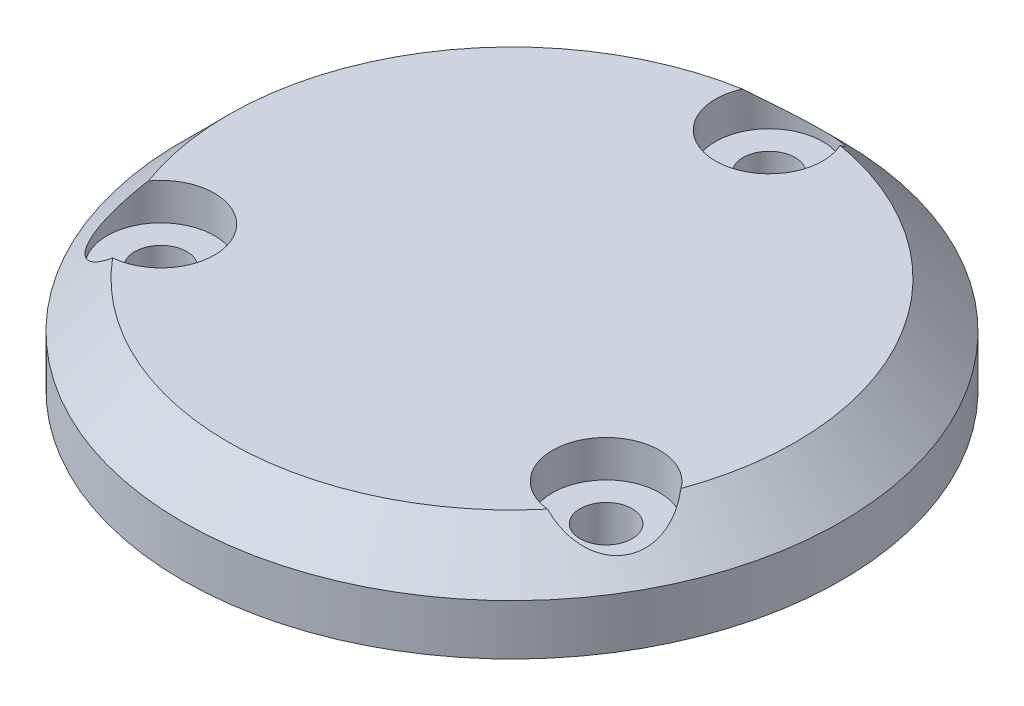
ISO-10303-21;
HEADER;
FILE_DESCRIPTION(('STEP AP214'),'2;1');
FILE_NAME('part.step','',(''),(''),'','','');
FILE_SCHEMA(('AUTOMOTIVE_DESIGN { 1 0 10303 214 1 1 1 1 }'));
ENDSEC;
DATA;
#1=APPLICATION_CONTEXT('core data for automotive mechanical design processes');
#2=APPLICATION_PROTOCOL_DEFINITION('international standard','automotive_design',2000,#1);
#3=PRODUCT_CONTEXT('',#1,'mechanical');
#4=PRODUCT('Part','Part','',(#3));
#5=PRODUCT_RELATED_PRODUCT_CATEGORY('part','',(#4));
#6=PRODUCT_DEFINITION_FORMATION('','',#4);
#7=PRODUCT_DEFINITION_CONTEXT('part definition',#1,'design');
#8=PRODUCT_DEFINITION('design','',#6,#7);
#9=PRODUCT_DEFINITION_SHAPE('','',#8);
#10=(LENGTH_UNIT() NAMED_UNIT(*) SI_UNIT(.MILLI.,.METRE.));
#11=(NAMED_UNIT(*) PLANE_ANGLE_UNIT() SI_UNIT($,.RADIAN.));
#12=(NAMED_UNIT(*) SI_UNIT($,.STERADIAN.) SOLID_ANGLE_UNIT());
#13=UNCERTAINTY_MEASURE_WITH_UNIT(LENGTH_MEASURE(1.E-05),#10,'distance_accuracy_value','');
#14=(GEOMETRIC_REPRESENTATION_CONTEXT(3) GLOBAL_UNCERTAINTY_ASSIGNED_CONTEXT((#13)) GLOBAL_UNIT_ASSIGNED_CONTEXT((#10,
#11,#12)) REPRESENTATION_CONTEXT('',''));
#15=CARTESIAN_POINT('',(0.,0.,0.));
#16=DIRECTION('',(0.,0.,1.));
#17=DIRECTION('',(1.,0.,0.));
#18=AXIS2_PLACEMENT_3D('',#15,#16,#17);
#19=CARTESIAN_POINT('',(0.,0.,0.));
#20=DIRECTION('',(0.,-1.,0.));
#21=DIRECTION('',(0.,0.,1.));
#22=AXIS2_PLACEMENT_3D('',#19,#20,#21);
#23=CONICAL_SURFACE('',#22,21.5,0.78539816339745);
#24=CARTESIAN_POINT('',(0.,3.,0.));
#25=DIRECTION('',(0.,1.,0.));
#26=DIRECTION('',(0.,0.,1.));
#27=AXIS2_PLACEMENT_3D('',#24,#25,#26);
#28=CIRCLE('',#27,18.5);
#29=CARTESIAN_POINT('',(17.3746610155181,3.,6.35382991555764));
#30=VERTEX_POINT('',#29);
#31=CARTESIAN_POINT('',(3.18475238956052,3.,-18.2238127793606));
#32=VERTEX_POINT('',#31);
#33=EDGE_CURVE('E76',#30,#32,#28,.T.);
#34=ORIENTED_EDGE('',*,*,#33,.F.);
#35=CARTESIAN_POINT('',(17.3745202408479,3.0002,6.35363253897836));
#36=CARTESIAN_POINT('',(17.4408834815488,2.90590349368825,6.44669053262444));
#37=CARTESIAN_POINT('',(17.5035508380758,2.81323765815927,6.54417719327068));
#38=CARTESIAN_POINT('',(17.620389713538,2.63180283355036,6.74806807999824));
#39=CARTESIAN_POINT('',(17.6745370575812,2.54304542985675,6.85449641180674));
#40=CARTESIAN_POINT('',(17.7732567163015,2.36988104281534,7.07673061506786));
#41=CARTESIAN_POINT('',(17.817745577553,2.28551642175723,7.19260717017322));
#42=CARTESIAN_POINT('',(17.8950256904219,2.12312238685081,7.43240999108055));
#43=CARTESIAN_POINT('',(17.9278195054571,2.04509158760248,7.5563344858199));
#44=CARTESIAN_POINT('',(17.9869703072409,1.87705860219996,7.84519214050658));
#45=CARTESIAN_POINT('',(18.0093417574277,1.7893351627532,8.01231391284139));
#46=CARTESIAN_POINT('',(18.0291408416712,1.62960245637797,8.35497884383426));
#47=CARTESIAN_POINT('',(18.0266476619816,1.55754404977609,8.5304934976238));
#48=CARTESIAN_POINT('',(18.001982393865,1.46343693424988,8.79770675194085));
#49=CARTESIAN_POINT('',(17.9901448797507,1.43427284469639,8.8879592894284));
#50=CARTESIAN_POINT('',(17.9590997492058,1.38126229939119,9.06873935987347));
#51=CARTESIAN_POINT('',(17.9398962036225,1.35741291794821,9.15926671358677));
#52=CARTESIAN_POINT('',(17.8939536185924,1.31544622034291,9.33974669251927));
#53=CARTESIAN_POINT('',(17.867214183496,1.29732920524765,9.42969928730878));
#54=CARTESIAN_POINT('',(17.8062016273403,1.26718269802608,9.60805535998536));
#55=CARTESIAN_POINT('',(17.7719298920767,1.25515208746318,9.69645911960164));
#56=CARTESIAN_POINT('',(17.7014400395264,1.23868679855146,9.85831760835918));
#57=CARTESIAN_POINT('',(17.6661906129192,1.23341563635561,9.93211143936025));
#58=CARTESIAN_POINT('',(17.5905063200581,1.22761621961303,10.0772178737105));
#59=CARTESIAN_POINT('',(17.5500698216968,1.22708946161983,10.1485296870779));
#60=CARTESIAN_POINT('',(17.4643804169535,1.23079310342182,10.2879954726762));
#61=CARTESIAN_POINT('',(17.4191313242759,1.23501976146686,10.3561518848029));
#62=CARTESIAN_POINT('',(17.3242067089713,1.24815020094312,10.4888470025768));
#63=CARTESIAN_POINT('',(17.2745295323794,1.25705573614484,10.5533843416514));
#64=CARTESIAN_POINT('',(17.1267617187349,1.28904928728341,10.7321381288477));
#65=CARTESIAN_POINT('',(17.0237500685274,1.31774851664976,10.8413909819881));
#66=CARTESIAN_POINT('',(16.8074909983411,1.38948006796563,11.0436394321701));
#67=CARTESIAN_POINT('',(16.694242693125,1.43251363037388,11.1366336211635));
#68=CARTESIAN_POINT('',(16.4522014492174,1.53473529297177,11.311851812817));
#69=CARTESIAN_POINT('',(16.3228778480425,1.59487891454827,11.3927802343212));
#70=CARTESIAN_POINT('',(16.0598297983463,1.72726659139198,11.5352022938071));
#71=CARTESIAN_POINT('',(15.9261019347735,1.79952022309339,11.5966804387844));
#72=CARTESIAN_POINT('',(15.5948733256104,1.98975422086964,11.7252475569562));
#73=CARTESIAN_POINT('',(15.3965134681776,2.11341690607473,11.7817548018549));
#74=CARTESIAN_POINT('',(15.0032495667299,2.37640660799702,11.8590594952725));
#75=CARTESIAN_POINT('',(14.8083506383994,2.5157548869167,11.8798078353438));
#76=CARTESIAN_POINT('',(14.5448319648297,2.71582496173181,11.8867703796734));
#77=CARTESIAN_POINT('',(14.4727029266071,2.77184017258531,11.886409708216));
#78=CARTESIAN_POINT('',(14.3300412025687,2.8850916839218,11.8813556271393));
#79=CARTESIAN_POINT('',(14.2595032032715,2.94232206815479,11.8766799056237));
#80=CARTESIAN_POINT('',(14.1896673054908,3.0002,11.8699596376519));
#81=B_SPLINE_CURVE_WITH_KNOTS('',3,(#35,#36,#37,#38,#39,#40,#41,#42,#43,#44,#45,#46,#47,#48,#49,
#50,#51,#52,#53,#54,#55,#56,#57,#58,#59,#60,#61,#62,#63,#64,#65,#66,#67,#68,#69,#70,#71,#72,#73,
#74,#75,#76,#77,#78,#79,#80),.UNSPECIFIED.,.F.,.F.,(4,2,2,2,2,2,2,2,2,2,2,2,2,2,2,2,2,2,2,2,2,2,
4),(0.,0.444533927812083,0.890307285921158,1.33979122177654,1.78917657535826,2.35721131959742,
2.92343762577456,3.20982621608787,3.49605676087222,3.78230233614892,4.06849529186779,
4.31401824830541,4.55961864868957,4.8050258548539,5.05052511201186,5.50697670387208,
5.96346780622246,6.4535407808461,6.94400314310954,7.66155467595662,8.3800908543357,
8.65397905030182,8.92674949638372),.UNSPECIFIED.);
#82=CARTESIAN_POINT('',(14.1899086259576,3.,11.8699828638029));
#83=VERTEX_POINT('',#82);
#84=EDGE_CURVE('E11',#30,#83,#81,.T.);
#85=ORIENTED_EDGE('',*,*,#84,.T.);
#86=CARTESIAN_POINT('',(-14.1899086259575,3.,11.8699828638029));
#87=VERTEX_POINT('',#86);
#88=EDGE_CURVE('E78',#87,#83,#28,.T.);
#89=ORIENTED_EDGE('',*,*,#88,.F.);
#90=CARTESIAN_POINT('',(-14.1896673054907,3.0002,11.869959637652));
#91=CARTESIAN_POINT('',(-14.3034395123638,2.90590349368824,11.8809028931534));
#92=CARTESIAN_POINT('',(-14.4191991152771,2.81323765815926,11.8864310855707));
#93=CARTESIAN_POINT('',(-14.6541932405144,2.63180283355035,11.8856710765067));
#94=CARTESIAN_POINT('',(-14.7734365515645,2.54304542985675,11.8793498860914));
#95=CARTESIAN_POINT('',(-15.0152568465386,2.36988104281534,11.8537265167656));
#96=CARTESIAN_POINT('',(-15.1378533175886,2.28551642175723,11.8343167232421));
#97=CARTESIAN_POINT('',(-15.384168708828,2.12312238685081,11.7813418537403));
#98=CARTESIAN_POINT('',(-15.5078873769411,2.04509158760248,11.7477798832781));
#99=CARTESIAN_POINT('',(-15.7876208448692,1.87705860219996,11.6545771529337));
#100=CARTESIAN_POINT('',(-15.94353827033,1.7893351627532,11.5903905109475));
#101=CARTESIAN_POINT('',(-16.2501943476776,1.62960245637797,11.4362045553776));
#102=CARTESIAN_POINT('',(-16.400947906751,1.55754404977609,11.3462880715355));
#103=CARTESIAN_POINT('',(-16.6200287391592,1.46343693424988,11.1913206955969));
#104=CARTESIAN_POINT('',(-16.6922709723222,1.43427284469639,11.1359428389124));
#105=CARTESIAN_POINT('',(-16.8333085405532,1.3812622993912,11.0186669319742));
#106=CARTESIAN_POINT('',(-16.9021057558146,1.35741291794821,10.9567724967997));
#107=CARTESIAN_POINT('',(-17.0354347099296,1.31544622034292,10.8267450615819));
#108=CARTESIAN_POINT('',(-17.0999662246054,1.29732920524766,10.7586117341108));
#109=CARTESIAN_POINT('',(-17.2239208363847,1.26718269802608,10.6165952741918));
#110=CARTESIAN_POINT('',(-17.2833448703707,1.25515208746318,10.5427132010136));
#111=CARTESIAN_POINT('',(-17.3882735071777,1.23868679855147,10.4007379536173));
#112=CARTESIAN_POINT('',(-17.4345561261636,1.23341563635561,10.333314139206));
#113=CARTESIAN_POINT('',(-17.522379838133,1.22761621961303,10.1952164017458));
#114=CARTESIAN_POINT('',(-17.5639194309184,1.22708946161983,10.1245414602411));
#115=CARTESIAN_POINT('',(-17.6418556418336,1.23079310342182,9.98059936609903));
#116=CARTESIAN_POINT('',(-17.6782562798274,1.23501976146686,9.90733429627872));
#117=CARTESIAN_POINT('',(-17.7457113151255,1.24815020094312,9.75877960909355));
#118=CARTESIAN_POINT('',(-17.7767637019607,1.25705573614484,9.68348924263931));
#119=CARTESIAN_POINT('',(-17.8576851158731,1.28904928728342,9.46614166856334));
#120=CARTESIAN_POINT('',(-17.9007950370249,1.31774851664976,9.32230453602771));
#121=CARTESIAN_POINT('',(-17.9678177976654,1.38948006796563,9.03389446235662));
#122=CARTESIAN_POINT('',(-17.99172897513,1.43251363037388,8.88932145860723));
#123=CARTESIAN_POINT('',(-18.0224517583533,1.53473529297177,8.59209849679286));
#124=CARTESIAN_POINT('',(-18.0278760266767,1.59487891454827,8.43963676211447));
#125=CARTESIAN_POINT('',(-18.0196931234026,1.72726659139198,8.14061943891857));
#126=CARTESIAN_POINT('',(-18.0060708269441,1.79952022309339,7.99406863938205));
#127=CARTESIAN_POINT('',(-17.9517989127907,1.98975422086964,7.64293269030081));
#128=CARTESIAN_POINT('',(-17.9015556936545,2.11341690607474,7.44289439222354));
#129=CARTESIAN_POINT('',(-17.771871571262,2.37640660799703,7.06366551646969));
#130=CARTESIAN_POINT('',(-17.6923906966849,2.5157548869167,6.88450392332943));
#131=CARTESIAN_POINT('',(-17.5666611001644,2.71582496173182,6.65280878548174));
#132=CARTESIAN_POINT('',(-17.5302842304086,2.77184017258531,6.59052354175908));
#133=CARTESIAN_POINT('',(-17.4545764057842,2.88509168392181,6.46950190513249));
#134=CARTESIAN_POINT('',(-17.415258112522,2.94232206815479,6.41075206656681));
#135=CARTESIAN_POINT('',(-17.3745202408479,3.0002,6.35363253897847));
#136=B_SPLINE_CURVE_WITH_KNOTS('',3,(#90,#91,#92,#93,#94,#95,#96,#97,#98,#99,#100,#101,#102,
#103,#104,#105,#106,#107,#108,#109,#110,#111,#112,#113,#114,#115,#116,#117,#118,#119,#120,#121,
#122,#123,#124,#125,#126,#127,#128,#129,#130,#131,#132,#133,#134,#135),.UNSPECIFIED.,.F.,.F.,(4,
2,2,2,2,2,2,2,2,2,2,2,2,2,2,2,2,2,2,2,2,2,4),(0.,0.444533927812083,0.890307285921157,
1.33979122177654,1.78917657535826,2.35721131959742,2.92343762577455,3.20982621608786,
3.49605676087221,3.78230233614891,4.06849529186779,4.3140182483054,4.55961864868956,
4.80502585485389,5.05052511201185,5.50697670387207,5.96346780622246,6.45354078084609,
6.94400314310954,7.66155467595661,8.38009085433569,8.65397905030181,8.92674949638371),.UNSPECIFIED.);
#137=CARTESIAN_POINT('',(-17.3746610155181,3.,6.35382991555775));
#138=VERTEX_POINT('',#137);
#139=EDGE_CURVE('E45',#87,#138,#136,.T.);
#140=ORIENTED_EDGE('',*,*,#139,.T.);
#141=CARTESIAN_POINT('',(-3.18475238956052,3.,-18.2238127793606));
#142=VERTEX_POINT('',#141);
#143=EDGE_CURVE('E87',#142,#138,#28,.T.);
#144=ORIENTED_EDGE('',*,*,#143,.F.);
#145=CARTESIAN_POINT('',(-3.18485293535722,3.00020000000003,-18.2235921766304));
#146=CARTESIAN_POINT('',(-3.13744396918496,2.90590349368828,-18.3275934257779));
#147=CARTESIAN_POINT('',(-3.08435172279867,2.8132376581593,-18.4306082788414));
#148=CARTESIAN_POINT('',(-2.96619647302357,2.63180283355039,-18.633739156505));
#149=CARTESIAN_POINT('',(-2.90110050601661,2.54304542985679,-18.7338462978981));
#150=CARTESIAN_POINT('',(-2.75799986976287,2.36988104281537,-18.9304571318334));
#151=CARTESIAN_POINT('',(-2.67989225996432,2.28551642175726,-19.0269238934153));
#152=CARTESIAN_POINT('',(-2.51085698159389,2.12312238685083,-19.2137518448208));
#153=CARTESIAN_POINT('',(-2.41993212851605,2.0450915876025,-19.304114369098));
#154=CARTESIAN_POINT('',(-2.19934946237169,1.87705860219998,-19.4997692934403));
#155=CARTESIAN_POINT('',(-2.06580348709764,1.78933516275322,-19.6027044237889));
#156=CARTESIAN_POINT('',(-1.77894649399353,1.62960245637799,-19.7911833992119));
#157=CARTESIAN_POINT('',(-1.62569975523055,1.55754404977611,-19.8767815691593));
#158=CARTESIAN_POINT('',(-1.38195365470581,1.46343693424989,-19.9890274475377));
#159=CARTESIAN_POINT('',(-1.29787390742839,1.43427284469641,-20.0239021283408));
#160=CARTESIAN_POINT('',(-1.12579120865261,1.38126229939121,-20.0874062918477));
#161=CARTESIAN_POINT('',(-1.03779044780785,1.35741291794822,-20.1160392103865));
#162=CARTESIAN_POINT('',(-0.858518908662793,1.31544622034292,-20.1664917541012));
#163=CARTESIAN_POINT('',(-0.767247958890529,1.29732920524766,-20.1883110214196));
#164=CARTESIAN_POINT('',(-0.582280790955559,1.26718269802608,-20.2246506341772));
#165=CARTESIAN_POINT('',(-0.488585021706002,1.25515208746318,-20.2391723206153));
#166=CARTESIAN_POINT('',(-0.313166532348649,1.23868679855147,-20.2590555619765));
#167=CARTESIAN_POINT('',(-0.231634486755542,1.23341563635562,-20.2654255785663));
#168=CARTESIAN_POINT('',(-0.0681264819250933,1.22761621961303,-20.2724342754563));
#169=CARTESIAN_POINT('',(0.0138496092216358,1.22708946161983,-20.273071147319));
#170=CARTESIAN_POINT('',(0.177475224880209,1.23079310342182,-20.2685948387753));
#171=CARTESIAN_POINT('',(0.259124955551497,1.23501976146686,-20.2634861810816));
#172=CARTESIAN_POINT('',(0.421504606154164,1.24815020094312,-20.2476266116704));
#173=CARTESIAN_POINT('',(0.502234169581412,1.25705573614484,-20.2368735842908));
#174=CARTESIAN_POINT('',(0.730923397138305,1.28904928728341,-20.198279797411));
#175=CARTESIAN_POINT('',(0.877044968497579,1.31774851664976,-20.1636955180158));
#176=CARTESIAN_POINT('',(1.16032679932433,1.38948006796563,-20.0775338945267));
#177=CARTESIAN_POINT('',(1.29748628200502,1.43251363037388,-20.0259550797708));
#178=CARTESIAN_POINT('',(1.57025030913598,1.53473529297177,-19.9039503096099));
#179=CARTESIAN_POINT('',(1.70499817863418,1.59487891454827,-19.8324169964357));
#180=CARTESIAN_POINT('',(1.95986332505643,1.72726659139197,-19.6758217327257));
#181=CARTESIAN_POINT('',(2.07996889217073,1.79952022309338,-19.5907490781665));
#182=CARTESIAN_POINT('',(2.35692558718033,1.98975422086963,-19.368180247257));
#183=CARTESIAN_POINT('',(2.50504222547694,2.11341690607472,-19.2246491940785));
#184=CARTESIAN_POINT('',(2.76862200453216,2.37640660799701,-18.9227250117423));
#185=CARTESIAN_POINT('',(2.88404005828555,2.51575488691668,-18.7643117586733));
#186=CARTESIAN_POINT('',(3.02182913533475,2.71582496173181,-18.5395791651551));
#187=CARTESIAN_POINT('',(3.05758130380159,2.77184017258531,-18.4769332499751));
#188=CARTESIAN_POINT('',(3.12453520321559,2.88509168392182,-18.3508575322718));
#189=CARTESIAN_POINT('',(3.1557549092506,2.94232206815482,-18.2874319721905));
#190=CARTESIAN_POINT('',(3.18485293535723,3.00020000000003,-18.2235921766304));
#191=B_SPLINE_CURVE_WITH_KNOTS('',3,(#145,#146,#147,#148,#149,#150,#151,#152,#153,#154,#155,
#156,#157,#158,#159,#160,#161,#162,#163,#164,#165,#166,#167,#168,#169,#170,#171,#172,#173,#174,
#175,#176,#177,#178,#179,#180,#181,#182,#183,#184,#185,#186,#187,#188,#189,#190),.UNSPECIFIED.,
.F.,.F.,(4,2,2,2,2,2,2,2,2,2,2,2,2,2,2,2,2,2,2,2,2,2,4),(0.,0.444533927812083,0.890307285921153,
1.33979122177653,1.78917657535826,2.35721131959743,2.92343762577456,3.20982621608787,
3.49605676087223,3.78230233614893,4.06849529186781,4.31401824830542,4.55961864868958,
4.80502585485392,5.05052511201188,5.50697670387209,5.96346780622248,6.45354078084611,
6.94400314310956,7.66155467595663,8.38009085433571,8.65397905030187,8.9267494963838),.UNSPECIFIED.);
#192=EDGE_CURVE('E84',#142,#32,#191,.T.);
#193=ORIENTED_EDGE('',*,*,#192,.T.);
#194=EDGE_LOOP('',(#34,#85,#89,#140,#144,#193));
#195=FACE_BOUND('',#194,.T.);
#196=CARTESIAN_POINT('',(0.,0.,0.));
#197=DIRECTION('',(0.,1.,0.));
#198=DIRECTION('',(0.,0.,1.));
#199=AXIS2_PLACEMENT_3D('',#196,#197,#198);
#200=CIRCLE('',#199,21.5);
#201=CARTESIAN_POINT('',(0.,0.,21.5));
#202=VERTEX_POINT('',#201);
#203=EDGE_CURVE('E89',#202,#202,#200,.T.);
#204=ORIENTED_EDGE('',*,*,#203,.T.);
#205=EDGE_LOOP('',(#204));
#206=FACE_BOUND('',#205,.T.);
#207=ADVANCED_FACE('F33',(#195,#206),#23,.T.);
#208=CARTESIAN_POINT('',(0.,3.,0.));
#209=DIRECTION('',(0.,1.,0.));
#210=DIRECTION('',(0.,0.,1.));
#211=AXIS2_PLACEMENT_3D('',#208,#209,#210);
#212=PLANE('',#211);
#213=CARTESIAN_POINT('',(14.5250998053597,3.,8.38607028263051));
#214=DIRECTION('',(0.,1.,0.));
#215=DIRECTION('',(0.,0.,1.));
#216=AXIS2_PLACEMENT_3D('',#213,#214,#215);
#217=CIRCLE('',#216,3.5);
#218=EDGE_CURVE('E51',#30,#83,#217,.T.);
#219=ORIENTED_EDGE('',*,*,#218,.F.);
#220=ORIENTED_EDGE('',*,*,#33,.T.);
#221=CARTESIAN_POINT('',(0.,3.,-16.7721405652611));
#222=DIRECTION('',(0.,1.,0.));
#223=DIRECTION('',(0.,0.,1.));
#224=AXIS2_PLACEMENT_3D('',#221,#222,#223);
#225=CIRCLE('',#224,3.5);
#226=EDGE_CURVE('E230',#142,#32,#225,.T.);
#227=ORIENTED_EDGE('',*,*,#226,.F.);
#228=ORIENTED_EDGE('',*,*,#143,.T.);
#229=CARTESIAN_POINT('',(-14.5250998053596,3.,8.3860702826306));
#230=DIRECTION('',(0.,1.,0.));
#231=DIRECTION('',(0.,0.,1.));
#232=AXIS2_PLACEMENT_3D('',#229,#230,#231);
#233=CIRCLE('',#232,3.5);
#234=EDGE_CURVE('E57',#87,#138,#233,.T.);
#235=ORIENTED_EDGE('',*,*,#234,.F.);
#236=ORIENTED_EDGE('',*,*,#88,.T.);
#237=EDGE_LOOP('',(#219,#220,#227,#228,#235,#236));
#238=FACE_BOUND('',#237,.T.);
#239=ADVANCED_FACE('F74',(#238),#212,.T.);
#240=CARTESIAN_POINT('',(0.,-3.3,0.));
#241=DIRECTION('',(0.,1.,0.));
#242=DIRECTION('',(0.,0.,1.));
#243=AXIS2_PLACEMENT_3D('',#240,#241,#242);
#244=CYLINDRICAL_SURFACE('',#243,21.5);
#245=CARTESIAN_POINT('',(0.,-3.3,0.));
#246=DIRECTION('',(0.,1.,0.));
#247=DIRECTION('',(0.,0.,1.));
#248=AXIS2_PLACEMENT_3D('',#245,#246,#247);
#249=CIRCLE('',#248,21.5);
#250=CARTESIAN_POINT('',(0.,-3.3,21.5));
#251=VERTEX_POINT('',#250);
#252=EDGE_CURVE('E85',#251,#251,#249,.T.);
#253=ORIENTED_EDGE('',*,*,#252,.T.);
#254=EDGE_LOOP('',(#253));
#255=FACE_BOUND('',#254,.T.);
#256=ORIENTED_EDGE('',*,*,#203,.F.);
#257=EDGE_LOOP('',(#256));
#258=FACE_BOUND('',#257,.T.);
#259=ADVANCED_FACE('F122',(#255,#258),#244,.T.);
#260=CARTESIAN_POINT('',(0.,-3.3,0.));
#261=DIRECTION('',(0.,1.,0.));
#262=DIRECTION('',(0.,0.,1.));
#263=AXIS2_PLACEMENT_3D('',#260,#261,#262);
#264=PLANE('',#263);
#265=CARTESIAN_POINT('',(14.5250998053597,-3.3,8.38607028263051));
#266=DIRECTION('',(0.,1.,0.));
#267=DIRECTION('',(0.,0.,1.));
#268=AXIS2_PLACEMENT_3D('',#265,#266,#267);
#269=CIRCLE('',#268,1.7);
#270=CARTESIAN_POINT('',(14.5250998053597,-3.3,10.0860702826305));
#271=VERTEX_POINT('',#270);
#272=EDGE_CURVE('E215',#271,#271,#269,.T.);
#273=ORIENTED_EDGE('',*,*,#272,.T.);
#274=EDGE_LOOP('',(#273));
#275=FACE_BOUND('',#274,.T.);
#276=CARTESIAN_POINT('',(-14.5250998053596,-3.3,8.3860702826306));
#277=DIRECTION('',(0.,1.,0.));
#278=DIRECTION('',(0.,0.,1.));
#279=AXIS2_PLACEMENT_3D('',#276,#277,#278);
#280=CIRCLE('',#279,1.7);
#281=CARTESIAN_POINT('',(-14.5250998053596,-3.3,10.0860702826306));
#282=VERTEX_POINT('',#281);
#283=EDGE_CURVE('E227',#282,#282,#280,.T.);
#284=ORIENTED_EDGE('',*,*,#283,.T.);
#285=EDGE_LOOP('',(#284));
#286=FACE_BOUND('',#285,.T.);
#287=CARTESIAN_POINT('',(0.,-3.3,-16.7721405652611));
#288=DIRECTION('',(0.,1.,0.));
#289=DIRECTION('',(0.,0.,1.));
#290=AXIS2_PLACEMENT_3D('',#287,#288,#289);
#291=CIRCLE('',#290,1.7);
#292=CARTESIAN_POINT('',(0.,-3.3,-15.0721405652611));
#293=VERTEX_POINT('',#292);
#294=EDGE_CURVE('E238',#293,#293,#291,.T.);
#295=ORIENTED_EDGE('',*,*,#294,.T.);
#296=EDGE_LOOP('',(#295));
#297=FACE_BOUND('',#296,.T.);
#298=ORIENTED_EDGE('',*,*,#252,.F.);
#299=EDGE_LOOP('',(#298));
#300=FACE_BOUND('',#299,.T.);
#301=ADVANCED_FACE('F108',(#275,#286,#297,#300),#264,.F.);
#302=CARTESIAN_POINT('',(0.,3.,-16.7721405652611));
#303=DIRECTION('',(0.,1.,0.));
#304=DIRECTION('',(0.,0.,1.));
#305=AXIS2_PLACEMENT_3D('',#302,#303,#304);
#306=CYLINDRICAL_SURFACE('',#305,3.5);
#307=CARTESIAN_POINT('',(0.,0.600000000000001,-16.7721405652611));
#308=DIRECTION('',(0.,1.,0.));
#309=DIRECTION('',(0.,0.,1.));
#310=AXIS2_PLACEMENT_3D('',#307,#308,#309);
#311=CIRCLE('',#310,3.5);
#312=CARTESIAN_POINT('',(0.,0.600000000000001,-13.2721405652611));
#313=VERTEX_POINT('',#312);
#314=EDGE_CURVE('E232',#313,#313,#311,.T.);
#315=ORIENTED_EDGE('',*,*,#314,.F.);
#316=EDGE_LOOP('',(#315));
#317=FACE_BOUND('',#316,.T.);
#318=ORIENTED_EDGE('',*,*,#226,.T.);
#319=ORIENTED_EDGE('',*,*,#192,.F.);
#320=EDGE_LOOP('',(#318,#319));
#321=FACE_BOUND('',#320,.T.);
#322=ADVANCED_FACE('F102',(#317,#321),#306,.F.);
#323=CARTESIAN_POINT('',(0.,3.,-16.7721405652611));
#324=DIRECTION('',(0.,1.,0.));
#325=DIRECTION('',(0.,0.,1.));
#326=AXIS2_PLACEMENT_3D('',#323,#324,#325);
#327=CYLINDRICAL_SURFACE('',#326,1.70000000000001);
#328=ORIENTED_EDGE('',*,*,#294,.F.);
#329=EDGE_LOOP('',(#328));
#330=FACE_BOUND('',#329,.T.);
#331=CARTESIAN_POINT('',(0.,0.600000000000001,-16.7721405652611));
#332=DIRECTION('',(0.,1.,0.));
#333=DIRECTION('',(0.,0.,1.));
#334=AXIS2_PLACEMENT_3D('',#331,#332,#333);
#335=CIRCLE('',#334,1.70000000000001);
#336=CARTESIAN_POINT('',(0.,0.600000000000001,-15.0721405652611));
#337=VERTEX_POINT('',#336);
#338=EDGE_CURVE('E235',#337,#337,#335,.T.);
#339=ORIENTED_EDGE('',*,*,#338,.T.);
#340=EDGE_LOOP('',(#339));
#341=FACE_BOUND('',#340,.T.);
#342=ADVANCED_FACE('F107',(#330,#341),#327,.F.);
#343=CARTESIAN_POINT('',(1.70000000000001,0.600000000000001,-16.7721405652611));
#344=DIRECTION('',(0.,-1.,0.));
#345=DIRECTION('',(0.,0.,-1.));
#346=AXIS2_PLACEMENT_3D('',#343,#344,#345);
#347=PLANE('',#346);
#348=ORIENTED_EDGE('',*,*,#338,.F.);
#349=EDGE_LOOP('',(#348));
#350=FACE_BOUND('',#349,.T.);
#351=ORIENTED_EDGE('',*,*,#314,.T.);
#352=EDGE_LOOP('',(#351));
#353=FACE_BOUND('',#352,.T.);
#354=ADVANCED_FACE('F112',(#350,#353),#347,.F.);
#355=CARTESIAN_POINT('',(-14.5250998053596,3.,8.3860702826306));
#356=DIRECTION('',(0.,1.,0.));
#357=DIRECTION('',(0.,0.,1.));
#358=AXIS2_PLACEMENT_3D('',#355,#356,#357);
#359=CYLINDRICAL_SURFACE('',#358,3.5);
#360=CARTESIAN_POINT('',(-14.5250998053596,0.600000000000001,8.3860702826306));
#361=DIRECTION('',(0.,1.,0.));
#362=DIRECTION('',(0.,0.,1.));
#363=AXIS2_PLACEMENT_3D('',#360,#361,#362);
#364=CIRCLE('',#363,3.5);
#365=CARTESIAN_POINT('',(-14.5250998053596,0.600000000000001,11.8860702826306));
#366=VERTEX_POINT('',#365);
#367=EDGE_CURVE('E221',#366,#366,#364,.T.);
#368=ORIENTED_EDGE('',*,*,#367,.F.);
#369=EDGE_LOOP('',(#368));
#370=FACE_BOUND('',#369,.T.);
#371=ORIENTED_EDGE('',*,*,#234,.T.);
#372=ORIENTED_EDGE('',*,*,#139,.F.);
#373=EDGE_LOOP('',(#371,#372));
#374=FACE_BOUND('',#373,.T.);
#375=ADVANCED_FACE('F115',(#370,#374),#359,.F.);
#376=CARTESIAN_POINT('',(-14.5250998053596,3.,8.3860702826306));
#377=DIRECTION('',(0.,1.,0.));
#378=DIRECTION('',(0.,0.,1.));
#379=AXIS2_PLACEMENT_3D('',#376,#377,#378);
#380=CYLINDRICAL_SURFACE('',#379,1.70000000000001);
#381=ORIENTED_EDGE('',*,*,#283,.F.);
#382=EDGE_LOOP('',(#381));
#383=FACE_BOUND('',#382,.T.);
#384=CARTESIAN_POINT('',(-14.5250998053596,0.600000000000001,8.3860702826306));
#385=DIRECTION('',(0.,1.,0.));
#386=DIRECTION('',(0.,0.,1.));
#387=AXIS2_PLACEMENT_3D('',#384,#385,#386);
#388=CIRCLE('',#387,1.70000000000001);
#389=CARTESIAN_POINT('',(-14.5250998053596,0.600000000000001,10.0860702826306));
#390=VERTEX_POINT('',#389);
#391=EDGE_CURVE('E224',#390,#390,#388,.T.);
#392=ORIENTED_EDGE('',*,*,#391,.T.);
#393=EDGE_LOOP('',(#392));
#394=FACE_BOUND('',#393,.T.);
#395=ADVANCED_FACE('F110',(#383,#394),#380,.F.);
#396=CARTESIAN_POINT('',(-12.8250998053596,0.600000000000001,8.3860702826306));
#397=DIRECTION('',(0.,-1.,0.));
#398=DIRECTION('',(0.,0.,-1.));
#399=AXIS2_PLACEMENT_3D('',#396,#397,#398);
#400=PLANE('',#399);
#401=ORIENTED_EDGE('',*,*,#391,.F.);
#402=EDGE_LOOP('',(#401));
#403=FACE_BOUND('',#402,.T.);
#404=ORIENTED_EDGE('',*,*,#367,.T.);
#405=EDGE_LOOP('',(#404));
#406=FACE_BOUND('',#405,.T.);
#407=ADVANCED_FACE('F166',(#403,#406),#400,.F.);
#408=CARTESIAN_POINT('',(14.5250998053597,3.,8.38607028263051));
#409=DIRECTION('',(0.,1.,0.));
#410=DIRECTION('',(0.,0.,1.));
#411=AXIS2_PLACEMENT_3D('',#408,#409,#410);
#412=CYLINDRICAL_SURFACE('',#411,3.5);
#413=CARTESIAN_POINT('',(14.5250998053597,0.600000000000001,8.38607028263051));
#414=DIRECTION('',(0.,1.,0.));
#415=DIRECTION('',(0.,0.,1.));
#416=AXIS2_PLACEMENT_3D('',#413,#414,#415);
#417=CIRCLE('',#416,3.5);
#418=CARTESIAN_POINT('',(14.5250998053597,0.600000000000001,11.8860702826305));
#419=VERTEX_POINT('',#418);
#420=EDGE_CURVE('E79',#419,#419,#417,.T.);
#421=ORIENTED_EDGE('',*,*,#420,.F.);
#422=EDGE_LOOP('',(#421));
#423=FACE_BOUND('',#422,.T.);
#424=ORIENTED_EDGE('',*,*,#218,.T.);
#425=ORIENTED_EDGE('',*,*,#84,.F.);
#426=EDGE_LOOP('',(#424,#425));
#427=FACE_BOUND('',#426,.T.);
#428=ADVANCED_FACE('F68',(#423,#427),#412,.F.);
#429=CARTESIAN_POINT('',(14.5250998053597,3.,8.38607028263051));
#430=DIRECTION('',(0.,1.,0.));
#431=DIRECTION('',(0.,0.,1.));
#432=AXIS2_PLACEMENT_3D('',#429,#430,#431);
#433=CYLINDRICAL_SURFACE('',#432,1.70000000000001);
#434=ORIENTED_EDGE('',*,*,#272,.F.);
#435=EDGE_LOOP('',(#434));
#436=FACE_BOUND('',#435,.T.);
#437=CARTESIAN_POINT('',(14.5250998053597,0.600000000000001,8.38607028263051));
#438=DIRECTION('',(0.,1.,0.));
#439=DIRECTION('',(0.,0.,1.));
#440=AXIS2_PLACEMENT_3D('',#437,#438,#439);
#441=CIRCLE('',#440,1.70000000000001);
#442=CARTESIAN_POINT('',(14.5250998053597,0.600000000000001,10.0860702826305));
#443=VERTEX_POINT('',#442);
#444=EDGE_CURVE('E211',#443,#443,#441,.T.);
#445=ORIENTED_EDGE('',*,*,#444,.T.);
#446=EDGE_LOOP('',(#445));
#447=FACE_BOUND('',#446,.T.);
#448=ADVANCED_FACE('F183',(#436,#447),#433,.F.);
#449=CARTESIAN_POINT('',(16.2250998053597,0.600000000000001,8.38607028263051));
#450=DIRECTION('',(0.,-1.,0.));
#451=DIRECTION('',(0.,0.,-1.));
#452=AXIS2_PLACEMENT_3D('',#449,#450,#451);
#453=PLANE('',#452);
#454=ORIENTED_EDGE('',*,*,#444,.F.);
#455=EDGE_LOOP('',(#454));
#456=FACE_BOUND('',#455,.T.);
#457=ORIENTED_EDGE('',*,*,#420,.T.);
#458=EDGE_LOOP('',(#457));
#459=FACE_BOUND('',#458,.T.);
#460=ADVANCED_FACE('F192',(#456,#459),#453,.F.);
#461=CLOSED_SHELL('',(#207,#239,#259,#301,#322,#342,#354,#375,#395,#407,#428,#448,#460));
#462=MANIFOLD_SOLID_BREP('B2',#461);
#463=ADVANCED_BREP_SHAPE_REPRESENTATION('',(#18,#462),#14);
#464=SHAPE_DEFINITION_REPRESENTATION(#9,#463);
ENDSEC;
END-ISO-10303-21;
